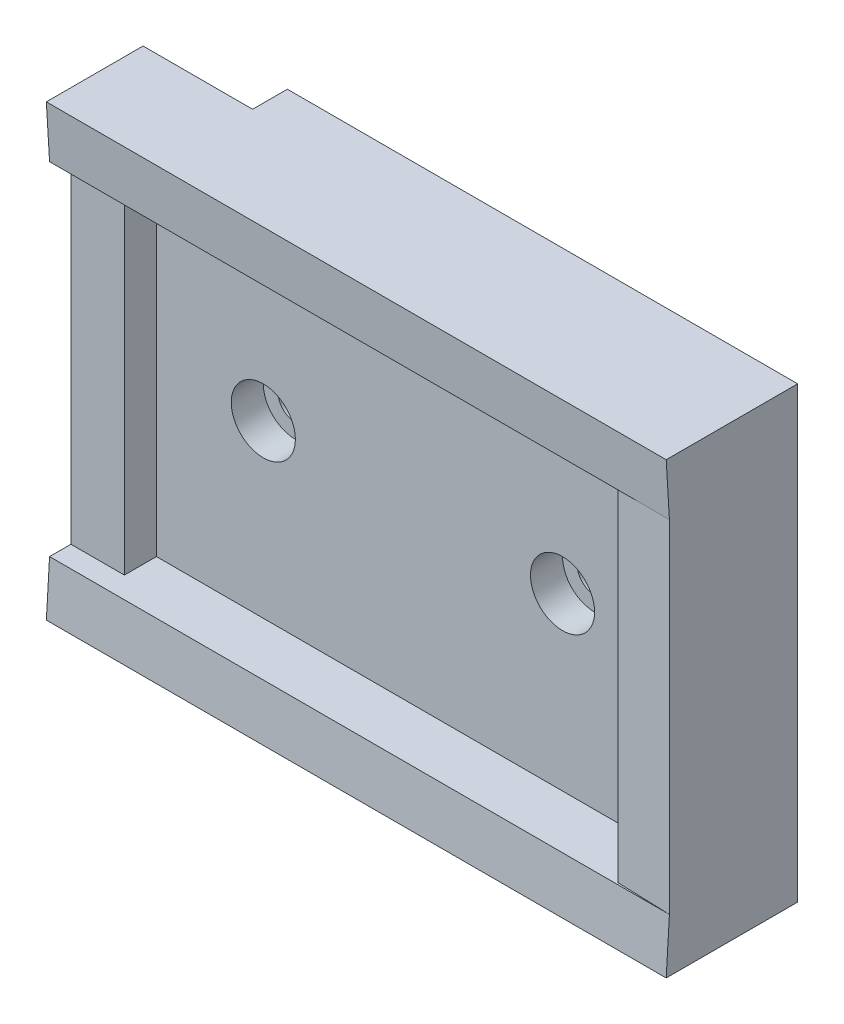
ISO-10303-21;
HEADER;
FILE_DESCRIPTION(('STEP AP214'),'2;1');
FILE_NAME('part.step','',(''),(''),'','','');
FILE_SCHEMA(('AUTOMOTIVE_DESIGN { 1 0 10303 214 1 1 1 1 }'));
ENDSEC;
DATA;
#1=APPLICATION_CONTEXT('core data for automotive mechanical design processes');
#2=APPLICATION_PROTOCOL_DEFINITION('international standard','automotive_design',2000,#1);
#3=PRODUCT_CONTEXT('',#1,'mechanical');
#4=PRODUCT('Part','Part','',(#3));
#5=PRODUCT_RELATED_PRODUCT_CATEGORY('part','',(#4));
#6=PRODUCT_DEFINITION_FORMATION('','',#4);
#7=PRODUCT_DEFINITION_CONTEXT('part definition',#1,'design');
#8=PRODUCT_DEFINITION('design','',#6,#7);
#9=PRODUCT_DEFINITION_SHAPE('','',#8);
#10=(LENGTH_UNIT() NAMED_UNIT(*) SI_UNIT(.MILLI.,.METRE.));
#11=(NAMED_UNIT(*) PLANE_ANGLE_UNIT() SI_UNIT($,.RADIAN.));
#12=(NAMED_UNIT(*) SI_UNIT($,.STERADIAN.) SOLID_ANGLE_UNIT());
#13=UNCERTAINTY_MEASURE_WITH_UNIT(LENGTH_MEASURE(1.E-05),#10,'distance_accuracy_value','');
#14=(GEOMETRIC_REPRESENTATION_CONTEXT(3) GLOBAL_UNCERTAINTY_ASSIGNED_CONTEXT((#13)) GLOBAL_UNIT_ASSIGNED_CONTEXT((#10,
#11,#12)) REPRESENTATION_CONTEXT('',''));
#15=CARTESIAN_POINT('',(0.,0.,0.));
#16=DIRECTION('',(0.,0.,1.));
#17=DIRECTION('',(1.,0.,0.));
#18=AXIS2_PLACEMENT_3D('',#15,#16,#17);
#19=CARTESIAN_POINT('',(0.,0.,7.));
#20=DIRECTION('',(1.,0.,0.));
#21=DIRECTION('',(0.,1.,0.));
#22=AXIS2_PLACEMENT_3D('',#19,#20,#21);
#23=PLANE('',#22);
#24=DIRECTION('',(0.,1.,0.));
#25=VECTOR('',#24,1.);
#26=CARTESIAN_POINT('',(0.,-42.,3.25));
#27=LINE('',#26,#25);
#28=CARTESIAN_POINT('',(0.,-37.,3.25));
#29=VERTEX_POINT('',#28);
#30=CARTESIAN_POINT('',(0.,4.99999999999999,3.25));
#31=VERTEX_POINT('',#30);
#32=EDGE_CURVE('E47',#29,#31,#27,.T.);
#33=ORIENTED_EDGE('',*,*,#32,.F.);
#34=DIRECTION('',(0.,0.,-1.));
#35=VECTOR('',#34,1.);
#36=CARTESIAN_POINT('',(0.,-37.,12.));
#37=LINE('',#36,#35);
#38=CARTESIAN_POINT('',(0.,-37.,12.3));
#39=VERTEX_POINT('',#38);
#40=EDGE_CURVE('E126',#39,#29,#37,.T.);
#41=ORIENTED_EDGE('',*,*,#40,.F.);
#42=DIRECTION('',(0.,0.998204845465779,-0.0598922907279467));
#43=VECTOR('',#42,1.);
#44=CARTESIAN_POINT('',(0.,-37.,12.3));
#45=LINE('',#44,#43);
#46=CARTESIAN_POINT('',(0.,-32.,12.));
#47=VERTEX_POINT('',#46);
#48=EDGE_CURVE('E303',#39,#47,#45,.T.);
#49=ORIENTED_EDGE('',*,*,#48,.T.);
#50=DIRECTION('',(0.,0.,-1.));
#51=VECTOR('',#50,1.);
#52=CARTESIAN_POINT('',(0.,-32.,12.));
#53=LINE('',#52,#51);
#54=CARTESIAN_POINT('',(0.,-32.,10.));
#55=VERTEX_POINT('',#54);
#56=EDGE_CURVE('E144',#47,#55,#53,.T.);
#57=ORIENTED_EDGE('',*,*,#56,.T.);
#58=DIRECTION('',(0.,-1.,0.));
#59=VECTOR('',#58,1.);
#60=CARTESIAN_POINT('',(0.,0.,10.));
#61=LINE('',#60,#59);
#62=CARTESIAN_POINT('',(0.,0.,10.));
#63=VERTEX_POINT('',#62);
#64=EDGE_CURVE('E206',#63,#55,#61,.T.);
#65=ORIENTED_EDGE('',*,*,#64,.F.);
#66=DIRECTION('',(0.,0.,-1.));
#67=VECTOR('',#66,1.);
#68=CARTESIAN_POINT('',(0.,0.,12.));
#69=LINE('',#68,#67);
#70=CARTESIAN_POINT('',(0.,0.,12.));
#71=VERTEX_POINT('',#70);
#72=EDGE_CURVE('E158',#71,#63,#69,.T.);
#73=ORIENTED_EDGE('',*,*,#72,.F.);
#74=DIRECTION('',(0.,0.998204845465779,0.0598922907279468));
#75=VECTOR('',#74,1.);
#76=CARTESIAN_POINT('',(0.,4.99999999999999,12.3));
#77=LINE('',#76,#75);
#78=CARTESIAN_POINT('',(0.,4.99999999999999,12.3));
#79=VERTEX_POINT('',#78);
#80=EDGE_CURVE('E295',#71,#79,#77,.T.);
#81=ORIENTED_EDGE('',*,*,#80,.T.);
#82=DIRECTION('',(0.,0.,-1.));
#83=VECTOR('',#82,1.);
#84=CARTESIAN_POINT('',(0.,4.99999999999999,12.));
#85=LINE('',#84,#83);
#86=EDGE_CURVE('E129',#79,#31,#85,.T.);
#87=ORIENTED_EDGE('',*,*,#86,.T.);
#88=EDGE_LOOP('',(#33,#41,#49,#57,#65,#73,#81,#87));
#89=FACE_BOUND('',#88,.T.);
#90=ADVANCED_FACE('F33',(#89),#23,.F.);
#91=CARTESIAN_POINT('',(0.,0.,0.));
#92=DIRECTION('',(0.,0.,1.));
#93=DIRECTION('',(1.,0.,0.));
#94=AXIS2_PLACEMENT_3D('',#91,#92,#93);
#95=PLANE('',#94);
#96=CARTESIAN_POINT('',(43.,-16.,0.));
#97=DIRECTION('',(0.,0.,1.));
#98=DIRECTION('',(1.,0.,0.));
#99=AXIS2_PLACEMENT_3D('',#96,#97,#98);
#100=CIRCLE('',#99,1.625);
#101=CARTESIAN_POINT('',(44.625,-16.,0.));
#102=VERTEX_POINT('',#101);
#103=EDGE_CURVE('E180',#102,#102,#100,.T.);
#104=ORIENTED_EDGE('',*,*,#103,.T.);
#105=EDGE_LOOP('',(#104));
#106=FACE_BOUND('',#105,.T.);
#107=CARTESIAN_POINT('',(15.,-16.,0.));
#108=DIRECTION('',(0.,0.,1.));
#109=DIRECTION('',(1.,0.,0.));
#110=AXIS2_PLACEMENT_3D('',#107,#108,#109);
#111=CIRCLE('',#110,1.625);
#112=CARTESIAN_POINT('',(16.625,-16.,0.));
#113=VERTEX_POINT('',#112);
#114=EDGE_CURVE('E184',#113,#113,#111,.T.);
#115=ORIENTED_EDGE('',*,*,#114,.T.);
#116=EDGE_LOOP('',(#115));
#117=FACE_BOUND('',#116,.T.);
#118=DIRECTION('',(1.,0.,0.));
#119=VECTOR('',#118,1.);
#120=CARTESIAN_POINT('',(58.,-37.,0.));
#121=LINE('',#120,#119);
#122=CARTESIAN_POINT('',(10.25,-37.,0.));
#123=VERTEX_POINT('',#122);
#124=CARTESIAN_POINT('',(58.,-37.,0.));
#125=VERTEX_POINT('',#124);
#126=EDGE_CURVE('E290',#123,#125,#121,.T.);
#127=ORIENTED_EDGE('',*,*,#126,.F.);
#128=DIRECTION('',(0.,-1.,0.));
#129=VECTOR('',#128,1.);
#130=CARTESIAN_POINT('',(10.25,0.,0.));
#131=LINE('',#130,#129);
#132=CARTESIAN_POINT('',(10.25,4.99999999999999,0.));
#133=VERTEX_POINT('',#132);
#134=EDGE_CURVE('E11',#133,#123,#131,.T.);
#135=ORIENTED_EDGE('',*,*,#134,.F.);
#136=DIRECTION('',(-1.,0.,0.));
#137=VECTOR('',#136,1.);
#138=CARTESIAN_POINT('',(58.,5.,0.));
#139=LINE('',#138,#137);
#140=CARTESIAN_POINT('',(58.,5.,0.));
#141=VERTEX_POINT('',#140);
#142=EDGE_CURVE('E148',#141,#133,#139,.T.);
#143=ORIENTED_EDGE('',*,*,#142,.F.);
#144=DIRECTION('',(0.,1.,0.));
#145=VECTOR('',#144,1.);
#146=CARTESIAN_POINT('',(58.,0.,0.));
#147=LINE('',#146,#145);
#148=EDGE_CURVE('E224',#125,#141,#147,.T.);
#149=ORIENTED_EDGE('',*,*,#148,.F.);
#150=EDGE_LOOP('',(#127,#135,#143,#149));
#151=FACE_BOUND('',#150,.T.);
#152=ADVANCED_FACE('F249',(#106,#117,#151),#95,.F.);
#153=CARTESIAN_POINT('',(58.,5.,12.));
#154=DIRECTION('',(0.,-1.,0.));
#155=DIRECTION('',(1.,0.,0.));
#156=AXIS2_PLACEMENT_3D('',#153,#154,#155);
#157=PLANE('',#156);
#158=DIRECTION('',(0.,0.,-1.));
#159=VECTOR('',#158,1.);
#160=CARTESIAN_POINT('',(10.25,4.99999999999999,3.25));
#161=LINE('',#160,#159);
#162=CARTESIAN_POINT('',(10.25,4.99999999999999,3.25));
#163=VERTEX_POINT('',#162);
#164=EDGE_CURVE('E138',#163,#133,#161,.T.);
#165=ORIENTED_EDGE('',*,*,#164,.F.);
#166=DIRECTION('',(1.,0.,0.));
#167=VECTOR('',#166,1.);
#168=CARTESIAN_POINT('',(0.,4.99999999999999,3.25));
#169=LINE('',#168,#167);
#170=EDGE_CURVE('E307',#31,#163,#169,.T.);
#171=ORIENTED_EDGE('',*,*,#170,.F.);
#172=ORIENTED_EDGE('',*,*,#86,.F.);
#173=DIRECTION('',(-1.,0.,0.));
#174=VECTOR('',#173,1.);
#175=CARTESIAN_POINT('',(58.,5.,12.3));
#176=LINE('',#175,#174);
#177=CARTESIAN_POINT('',(58.,5.,12.3));
#178=VERTEX_POINT('',#177);
#179=EDGE_CURVE('E286',#178,#79,#176,.T.);
#180=ORIENTED_EDGE('',*,*,#179,.F.);
#181=DIRECTION('',(0.,0.,-1.));
#182=VECTOR('',#181,1.);
#183=CARTESIAN_POINT('',(58.,5.,12.));
#184=LINE('',#183,#182);
#185=EDGE_CURVE('E130',#178,#141,#184,.T.);
#186=ORIENTED_EDGE('',*,*,#185,.T.);
#187=ORIENTED_EDGE('',*,*,#142,.T.);
#188=EDGE_LOOP('',(#165,#171,#172,#180,#186,#187));
#189=FACE_BOUND('',#188,.T.);
#190=ADVANCED_FACE('F239',(#189),#157,.F.);
#191=CARTESIAN_POINT('',(15.,-16.,0.));
#192=DIRECTION('',(0.,0.,1.));
#193=DIRECTION('',(1.,0.,0.));
#194=AXIS2_PLACEMENT_3D('',#191,#192,#193);
#195=CYLINDRICAL_SURFACE('',#194,1.625);
#196=ORIENTED_EDGE('',*,*,#114,.F.);
#197=EDGE_LOOP('',(#196));
#198=FACE_BOUND('',#197,.T.);
#199=CARTESIAN_POINT('',(15.,-16.,4.));
#200=DIRECTION('',(0.,0.,1.));
#201=DIRECTION('',(1.,0.,0.));
#202=AXIS2_PLACEMENT_3D('',#199,#200,#201);
#203=CIRCLE('',#202,1.625);
#204=CARTESIAN_POINT('',(16.625,-16.,4.));
#205=VERTEX_POINT('',#204);
#206=EDGE_CURVE('E187',#205,#205,#203,.F.);
#207=ORIENTED_EDGE('',*,*,#206,.F.);
#208=EDGE_LOOP('',(#207));
#209=FACE_BOUND('',#208,.T.);
#210=ADVANCED_FACE('F236',(#198,#209),#195,.F.);
#211=CARTESIAN_POINT('',(43.,-16.,0.));
#212=DIRECTION('',(0.,0.,1.));
#213=DIRECTION('',(1.,0.,0.));
#214=AXIS2_PLACEMENT_3D('',#211,#212,#213);
#215=CYLINDRICAL_SURFACE('',#214,1.625);
#216=ORIENTED_EDGE('',*,*,#103,.F.);
#217=EDGE_LOOP('',(#216));
#218=FACE_BOUND('',#217,.T.);
#219=CARTESIAN_POINT('',(43.,-16.,4.));
#220=DIRECTION('',(0.,0.,1.));
#221=DIRECTION('',(1.,0.,0.));
#222=AXIS2_PLACEMENT_3D('',#219,#220,#221);
#223=CIRCLE('',#222,1.625);
#224=CARTESIAN_POINT('',(44.625,-16.,4.));
#225=VERTEX_POINT('',#224);
#226=EDGE_CURVE('E171',#225,#225,#223,.F.);
#227=ORIENTED_EDGE('',*,*,#226,.F.);
#228=EDGE_LOOP('',(#227));
#229=FACE_BOUND('',#228,.T.);
#230=ADVANCED_FACE('F238',(#218,#229),#215,.F.);
#231=CARTESIAN_POINT('',(0.,0.,7.));
#232=DIRECTION('',(0.,0.,1.));
#233=DIRECTION('',(1.,0.,0.));
#234=AXIS2_PLACEMENT_3D('',#231,#232,#233);
#235=PLANE('',#234);
#236=CARTESIAN_POINT('',(15.,-16.,7.));
#237=DIRECTION('',(0.,0.,1.));
#238=DIRECTION('',(1.,0.,0.));
#239=AXIS2_PLACEMENT_3D('',#236,#237,#238);
#240=CIRCLE('',#239,3.);
#241=CARTESIAN_POINT('',(18.,-16.,7.));
#242=VERTEX_POINT('',#241);
#243=EDGE_CURVE('E172',#242,#242,#240,.T.);
#244=ORIENTED_EDGE('',*,*,#243,.F.);
#245=EDGE_LOOP('',(#244));
#246=FACE_BOUND('',#245,.T.);
#247=CARTESIAN_POINT('',(43.,-16.,7.));
#248=DIRECTION('',(0.,0.,1.));
#249=DIRECTION('',(1.,0.,0.));
#250=AXIS2_PLACEMENT_3D('',#247,#248,#249);
#251=CIRCLE('',#250,3.);
#252=CARTESIAN_POINT('',(46.,-16.,7.));
#253=VERTEX_POINT('',#252);
#254=EDGE_CURVE('E167',#253,#253,#251,.T.);
#255=ORIENTED_EDGE('',*,*,#254,.F.);
#256=EDGE_LOOP('',(#255));
#257=FACE_BOUND('',#256,.T.);
#258=DIRECTION('',(1.,0.,0.));
#259=VECTOR('',#258,1.);
#260=CARTESIAN_POINT('',(0.,-32.,7.));
#261=LINE('',#260,#259);
#262=CARTESIAN_POINT('',(5.,-32.,7.));
#263=VERTEX_POINT('',#262);
#264=CARTESIAN_POINT('',(53.,-32.,7.));
#265=VERTEX_POINT('',#264);
#266=EDGE_CURVE('E225',#263,#265,#261,.T.);
#267=ORIENTED_EDGE('',*,*,#266,.T.);
#268=DIRECTION('',(0.,-1.,0.));
#269=VECTOR('',#268,1.);
#270=CARTESIAN_POINT('',(53.,0.,7.));
#271=LINE('',#270,#269);
#272=CARTESIAN_POINT('',(53.,0.,7.));
#273=VERTEX_POINT('',#272);
#274=EDGE_CURVE('E196',#273,#265,#271,.T.);
#275=ORIENTED_EDGE('',*,*,#274,.F.);
#276=DIRECTION('',(-1.,0.,0.));
#277=VECTOR('',#276,1.);
#278=CARTESIAN_POINT('',(0.,0.,7.));
#279=LINE('',#278,#277);
#280=CARTESIAN_POINT('',(5.,0.,7.));
#281=VERTEX_POINT('',#280);
#282=EDGE_CURVE('E40',#273,#281,#279,.T.);
#283=ORIENTED_EDGE('',*,*,#282,.T.);
#284=DIRECTION('',(0.,1.,0.));
#285=VECTOR('',#284,1.);
#286=CARTESIAN_POINT('',(5.,0.,7.));
#287=LINE('',#286,#285);
#288=EDGE_CURVE('E205',#263,#281,#287,.T.);
#289=ORIENTED_EDGE('',*,*,#288,.F.);
#290=EDGE_LOOP('',(#267,#275,#283,#289));
#291=FACE_BOUND('',#290,.T.);
#292=ADVANCED_FACE('F246',(#246,#257,#291),#235,.T.);
#293=CARTESIAN_POINT('',(58.,0.,7.));
#294=DIRECTION('',(-1.,0.,0.));
#295=DIRECTION('',(0.,0.,1.));
#296=AXIS2_PLACEMENT_3D('',#293,#294,#295);
#297=PLANE('',#296);
#298=ORIENTED_EDGE('',*,*,#148,.T.);
#299=ORIENTED_EDGE('',*,*,#185,.F.);
#300=DIRECTION('',(0.,0.998204845465779,0.0598922907279468));
#301=VECTOR('',#300,1.);
#302=CARTESIAN_POINT('',(58.,5.,12.3));
#303=LINE('',#302,#301);
#304=CARTESIAN_POINT('',(58.,0.,12.));
#305=VERTEX_POINT('',#304);
#306=EDGE_CURVE('E291',#305,#178,#303,.T.);
#307=ORIENTED_EDGE('',*,*,#306,.F.);
#308=DIRECTION('',(0.,1.,0.));
#309=VECTOR('',#308,1.);
#310=CARTESIAN_POINT('',(58.,0.,12.));
#311=LINE('',#310,#309);
#312=CARTESIAN_POINT('',(58.,-32.,12.));
#313=VERTEX_POINT('',#312);
#314=EDGE_CURVE('E197',#313,#305,#311,.T.);
#315=ORIENTED_EDGE('',*,*,#314,.F.);
#316=DIRECTION('',(0.,0.998204845465779,-0.0598922907279467));
#317=VECTOR('',#316,1.);
#318=CARTESIAN_POINT('',(58.,-37.,12.3));
#319=LINE('',#318,#317);
#320=CARTESIAN_POINT('',(58.,-37.,12.3));
#321=VERTEX_POINT('',#320);
#322=EDGE_CURVE('E305',#321,#313,#319,.T.);
#323=ORIENTED_EDGE('',*,*,#322,.F.);
#324=DIRECTION('',(0.,0.,-1.));
#325=VECTOR('',#324,1.);
#326=CARTESIAN_POINT('',(58.,-37.,12.));
#327=LINE('',#326,#325);
#328=EDGE_CURVE('E145',#321,#125,#327,.T.);
#329=ORIENTED_EDGE('',*,*,#328,.T.);
#330=EDGE_LOOP('',(#298,#299,#307,#315,#323,#329));
#331=FACE_BOUND('',#330,.T.);
#332=ADVANCED_FACE('F265',(#331),#297,.F.);
#333=CARTESIAN_POINT('',(5.,0.,10.));
#334=DIRECTION('',(-1.,0.,0.));
#335=DIRECTION('',(0.,-1.,0.));
#336=AXIS2_PLACEMENT_3D('',#333,#334,#335);
#337=PLANE('',#336);
#338=ORIENTED_EDGE('',*,*,#288,.T.);
#339=DIRECTION('',(0.,0.,-1.));
#340=VECTOR('',#339,1.);
#341=CARTESIAN_POINT('',(5.,0.,10.));
#342=LINE('',#341,#340);
#343=CARTESIAN_POINT('',(5.,0.,10.));
#344=VERTEX_POINT('',#343);
#345=EDGE_CURVE('E216',#344,#281,#342,.T.);
#346=ORIENTED_EDGE('',*,*,#345,.F.);
#347=DIRECTION('',(0.,1.,0.));
#348=VECTOR('',#347,1.);
#349=CARTESIAN_POINT('',(5.,0.,10.));
#350=LINE('',#349,#348);
#351=CARTESIAN_POINT('',(5.,-32.,10.));
#352=VERTEX_POINT('',#351);
#353=EDGE_CURVE('E212',#352,#344,#350,.T.);
#354=ORIENTED_EDGE('',*,*,#353,.F.);
#355=DIRECTION('',(0.,0.,-1.));
#356=VECTOR('',#355,1.);
#357=CARTESIAN_POINT('',(5.,-32.,10.));
#358=LINE('',#357,#356);
#359=EDGE_CURVE('E221',#352,#263,#358,.T.);
#360=ORIENTED_EDGE('',*,*,#359,.T.);
#361=EDGE_LOOP('',(#338,#346,#354,#360));
#362=FACE_BOUND('',#361,.T.);
#363=ADVANCED_FACE('F267',(#362),#337,.F.);
#364=CARTESIAN_POINT('',(0.,0.,10.));
#365=DIRECTION('',(0.,0.,1.));
#366=DIRECTION('',(1.,0.,0.));
#367=AXIS2_PLACEMENT_3D('',#364,#365,#366);
#368=PLANE('',#367);
#369=ORIENTED_EDGE('',*,*,#64,.T.);
#370=DIRECTION('',(1.,0.,0.));
#371=VECTOR('',#370,1.);
#372=CARTESIAN_POINT('',(0.,-32.,10.));
#373=LINE('',#372,#371);
#374=EDGE_CURVE('E209',#55,#352,#373,.T.);
#375=ORIENTED_EDGE('',*,*,#374,.T.);
#376=ORIENTED_EDGE('',*,*,#353,.T.);
#377=DIRECTION('',(-1.,0.,0.));
#378=VECTOR('',#377,1.);
#379=CARTESIAN_POINT('',(0.,0.,10.));
#380=LINE('',#379,#378);
#381=EDGE_CURVE('E214',#344,#63,#380,.T.);
#382=ORIENTED_EDGE('',*,*,#381,.T.);
#383=EDGE_LOOP('',(#369,#375,#376,#382));
#384=FACE_BOUND('',#383,.T.);
#385=ADVANCED_FACE('F273',(#384),#368,.T.);
#386=CARTESIAN_POINT('',(53.,0.,12.));
#387=DIRECTION('',(1.,0.,0.));
#388=DIRECTION('',(0.,1.,0.));
#389=AXIS2_PLACEMENT_3D('',#386,#387,#388);
#390=PLANE('',#389);
#391=DIRECTION('',(0.,0.,-1.));
#392=VECTOR('',#391,1.);
#393=CARTESIAN_POINT('',(53.,-32.,12.));
#394=LINE('',#393,#392);
#395=CARTESIAN_POINT('',(53.,-32.,11.8275862068966));
#396=VERTEX_POINT('',#395);
#397=EDGE_CURVE('E199',#396,#265,#394,.T.);
#398=ORIENTED_EDGE('',*,*,#397,.F.);
#399=DIRECTION('',(0.,1.,0.));
#400=VECTOR('',#399,1.);
#401=CARTESIAN_POINT('',(53.,0.,11.8275862068966));
#402=LINE('',#401,#400);
#403=CARTESIAN_POINT('',(53.,0.,11.8275862068966));
#404=VERTEX_POINT('',#403);
#405=EDGE_CURVE('E191',#396,#404,#402,.T.);
#406=ORIENTED_EDGE('',*,*,#405,.T.);
#407=DIRECTION('',(0.,0.,-1.));
#408=VECTOR('',#407,1.);
#409=CARTESIAN_POINT('',(53.,0.,12.));
#410=LINE('',#409,#408);
#411=EDGE_CURVE('E203',#404,#273,#410,.T.);
#412=ORIENTED_EDGE('',*,*,#411,.T.);
#413=ORIENTED_EDGE('',*,*,#274,.T.);
#414=EDGE_LOOP('',(#398,#406,#412,#413));
#415=FACE_BOUND('',#414,.T.);
#416=ADVANCED_FACE('F325',(#415),#390,.F.);
#417=CARTESIAN_POINT('',(0.,0.,10.));
#418=DIRECTION('',(0.0344622758397789,0.,-0.999405999353588));
#419=DIRECTION('',(-0.999405999353588,0.,-0.0344622758397789));
#420=AXIS2_PLACEMENT_3D('',#417,#418,#419);
#421=PLANE('',#420);
#422=DIRECTION('',(0.999405999353587,0.,0.0344622758397789));
#423=VECTOR('',#422,1.);
#424=CARTESIAN_POINT('',(0.,-32.,10.));
#425=LINE('',#424,#423);
#426=EDGE_CURVE('E183',#396,#313,#425,.T.);
#427=ORIENTED_EDGE('',*,*,#426,.T.);
#428=ORIENTED_EDGE('',*,*,#314,.T.);
#429=DIRECTION('',(0.999405999353587,0.,0.0344622758397789));
#430=VECTOR('',#429,1.);
#431=CARTESIAN_POINT('',(0.,0.,10.));
#432=LINE('',#431,#430);
#433=EDGE_CURVE('E188',#404,#305,#432,.T.);
#434=ORIENTED_EDGE('',*,*,#433,.F.);
#435=ORIENTED_EDGE('',*,*,#405,.F.);
#436=EDGE_LOOP('',(#427,#428,#434,#435));
#437=FACE_BOUND('',#436,.T.);
#438=ADVANCED_FACE('F314',(#437),#421,.F.);
#439=CARTESIAN_POINT('',(43.,-16.,4.));
#440=DIRECTION('',(0.,0.,1.));
#441=DIRECTION('',(1.,0.,0.));
#442=AXIS2_PLACEMENT_3D('',#439,#440,#441);
#443=PLANE('',#442);
#444=CARTESIAN_POINT('',(43.,-16.,4.));
#445=DIRECTION('',(0.,0.,1.));
#446=DIRECTION('',(1.,0.,0.));
#447=AXIS2_PLACEMENT_3D('',#444,#445,#446);
#448=CIRCLE('',#447,3.);
#449=CARTESIAN_POINT('',(46.,-16.,4.));
#450=VERTEX_POINT('',#449);
#451=EDGE_CURVE('E175',#450,#450,#448,.T.);
#452=ORIENTED_EDGE('',*,*,#451,.T.);
#453=EDGE_LOOP('',(#452));
#454=FACE_BOUND('',#453,.T.);
#455=ORIENTED_EDGE('',*,*,#226,.T.);
#456=EDGE_LOOP('',(#455));
#457=FACE_BOUND('',#456,.T.);
#458=ADVANCED_FACE('F341',(#454,#457),#443,.T.);
#459=CARTESIAN_POINT('',(43.,-16.,4.));
#460=DIRECTION('',(0.,0.,1.));
#461=DIRECTION('',(1.,0.,0.));
#462=AXIS2_PLACEMENT_3D('',#459,#460,#461);
#463=CYLINDRICAL_SURFACE('',#462,3.);
#464=ORIENTED_EDGE('',*,*,#451,.F.);
#465=EDGE_LOOP('',(#464));
#466=FACE_BOUND('',#465,.T.);
#467=ORIENTED_EDGE('',*,*,#254,.T.);
#468=EDGE_LOOP('',(#467));
#469=FACE_BOUND('',#468,.T.);
#470=ADVANCED_FACE('F345',(#466,#469),#463,.F.);
#471=CARTESIAN_POINT('',(15.,-16.,4.));
#472=DIRECTION('',(0.,0.,1.));
#473=DIRECTION('',(1.,0.,0.));
#474=AXIS2_PLACEMENT_3D('',#471,#472,#473);
#475=PLANE('',#474);
#476=CARTESIAN_POINT('',(15.,-16.,4.));
#477=DIRECTION('',(0.,0.,1.));
#478=DIRECTION('',(1.,0.,0.));
#479=AXIS2_PLACEMENT_3D('',#476,#477,#478);
#480=CIRCLE('',#479,3.);
#481=CARTESIAN_POINT('',(18.,-16.,4.));
#482=VERTEX_POINT('',#481);
#483=EDGE_CURVE('E168',#482,#482,#480,.T.);
#484=ORIENTED_EDGE('',*,*,#483,.T.);
#485=EDGE_LOOP('',(#484));
#486=FACE_BOUND('',#485,.T.);
#487=ORIENTED_EDGE('',*,*,#206,.T.);
#488=EDGE_LOOP('',(#487));
#489=FACE_BOUND('',#488,.T.);
#490=ADVANCED_FACE('F234',(#486,#489),#475,.T.);
#491=CARTESIAN_POINT('',(15.,-16.,4.));
#492=DIRECTION('',(0.,0.,1.));
#493=DIRECTION('',(1.,0.,0.));
#494=AXIS2_PLACEMENT_3D('',#491,#492,#493);
#495=CYLINDRICAL_SURFACE('',#494,3.);
#496=ORIENTED_EDGE('',*,*,#483,.F.);
#497=EDGE_LOOP('',(#496));
#498=FACE_BOUND('',#497,.T.);
#499=ORIENTED_EDGE('',*,*,#243,.T.);
#500=EDGE_LOOP('',(#499));
#501=FACE_BOUND('',#500,.T.);
#502=ADVANCED_FACE('F355',(#498,#501),#495,.F.);
#503=CARTESIAN_POINT('',(0.,-42.,3.25));
#504=DIRECTION('',(0.,0.,-1.));
#505=DIRECTION('',(-1.,0.,0.));
#506=AXIS2_PLACEMENT_3D('',#503,#504,#505);
#507=PLANE('',#506);
#508=DIRECTION('',(0.,1.,0.));
#509=VECTOR('',#508,1.);
#510=CARTESIAN_POINT('',(10.25,-42.,3.25));
#511=LINE('',#510,#509);
#512=CARTESIAN_POINT('',(10.25,-37.,3.25));
#513=VERTEX_POINT('',#512);
#514=EDGE_CURVE('E52',#513,#163,#511,.T.);
#515=ORIENTED_EDGE('',*,*,#514,.F.);
#516=DIRECTION('',(-1.,0.,0.));
#517=VECTOR('',#516,1.);
#518=CARTESIAN_POINT('',(0.,-37.,3.25));
#519=LINE('',#518,#517);
#520=EDGE_CURVE('E133',#513,#29,#519,.T.);
#521=ORIENTED_EDGE('',*,*,#520,.T.);
#522=ORIENTED_EDGE('',*,*,#32,.T.);
#523=ORIENTED_EDGE('',*,*,#170,.T.);
#524=EDGE_LOOP('',(#515,#521,#522,#523));
#525=FACE_BOUND('',#524,.T.);
#526=ADVANCED_FACE('F134',(#525),#507,.T.);
#527=CARTESIAN_POINT('',(10.25,-42.,0.));
#528=DIRECTION('',(-1.,0.,0.));
#529=DIRECTION('',(0.,0.,1.));
#530=AXIS2_PLACEMENT_3D('',#527,#528,#529);
#531=PLANE('',#530);
#532=ORIENTED_EDGE('',*,*,#134,.T.);
#533=DIRECTION('',(0.,0.,-1.));
#534=VECTOR('',#533,1.);
#535=CARTESIAN_POINT('',(10.25,-37.,3.25));
#536=LINE('',#535,#534);
#537=EDGE_CURVE('E137',#513,#123,#536,.T.);
#538=ORIENTED_EDGE('',*,*,#537,.F.);
#539=ORIENTED_EDGE('',*,*,#514,.T.);
#540=ORIENTED_EDGE('',*,*,#164,.T.);
#541=EDGE_LOOP('',(#532,#538,#539,#540));
#542=FACE_BOUND('',#541,.T.);
#543=ADVANCED_FACE('F362',(#542),#531,.T.);
#544=CARTESIAN_POINT('',(58.,0.,12.));
#545=DIRECTION('',(0.,1.,0.));
#546=DIRECTION('',(0.,0.,1.));
#547=AXIS2_PLACEMENT_3D('',#544,#545,#546);
#548=PLANE('',#547);
#549=ORIENTED_EDGE('',*,*,#381,.F.);
#550=ORIENTED_EDGE('',*,*,#345,.T.);
#551=ORIENTED_EDGE('',*,*,#282,.F.);
#552=ORIENTED_EDGE('',*,*,#411,.F.);
#553=ORIENTED_EDGE('',*,*,#433,.T.);
#554=DIRECTION('',(1.,0.,0.));
#555=VECTOR('',#554,1.);
#556=CARTESIAN_POINT('',(58.,0.,12.));
#557=LINE('',#556,#555);
#558=EDGE_CURVE('E155',#71,#305,#557,.T.);
#559=ORIENTED_EDGE('',*,*,#558,.F.);
#560=ORIENTED_EDGE('',*,*,#72,.T.);
#561=EDGE_LOOP('',(#549,#550,#551,#552,#553,#559,#560));
#562=FACE_BOUND('',#561,.T.);
#563=ADVANCED_FACE('F319',(#562),#548,.F.);
#564=CARTESIAN_POINT('',(58.,-32.,12.));
#565=DIRECTION('',(0.,-1.,0.));
#566=DIRECTION('',(0.,0.,-1.));
#567=AXIS2_PLACEMENT_3D('',#564,#565,#566);
#568=PLANE('',#567);
#569=ORIENTED_EDGE('',*,*,#426,.F.);
#570=ORIENTED_EDGE('',*,*,#397,.T.);
#571=ORIENTED_EDGE('',*,*,#266,.F.);
#572=ORIENTED_EDGE('',*,*,#359,.F.);
#573=ORIENTED_EDGE('',*,*,#374,.F.);
#574=ORIENTED_EDGE('',*,*,#56,.F.);
#575=DIRECTION('',(-1.,0.,0.));
#576=VECTOR('',#575,1.);
#577=CARTESIAN_POINT('',(58.,-32.,12.));
#578=LINE('',#577,#576);
#579=EDGE_CURVE('E151',#313,#47,#578,.T.);
#580=ORIENTED_EDGE('',*,*,#579,.F.);
#581=EDGE_LOOP('',(#569,#570,#571,#572,#573,#574,#580));
#582=FACE_BOUND('',#581,.T.);
#583=ADVANCED_FACE('F329',(#582),#568,.F.);
#584=CARTESIAN_POINT('',(58.,-37.,12.));
#585=DIRECTION('',(0.,1.,0.));
#586=DIRECTION('',(-1.,0.,0.));
#587=AXIS2_PLACEMENT_3D('',#584,#585,#586);
#588=PLANE('',#587);
#589=ORIENTED_EDGE('',*,*,#520,.F.);
#590=ORIENTED_EDGE('',*,*,#537,.T.);
#591=ORIENTED_EDGE('',*,*,#126,.T.);
#592=ORIENTED_EDGE('',*,*,#328,.F.);
#593=DIRECTION('',(-1.,0.,0.));
#594=VECTOR('',#593,1.);
#595=CARTESIAN_POINT('',(58.,-37.,12.3));
#596=LINE('',#595,#594);
#597=EDGE_CURVE('E142',#321,#39,#596,.T.);
#598=ORIENTED_EDGE('',*,*,#597,.T.);
#599=ORIENTED_EDGE('',*,*,#40,.T.);
#600=EDGE_LOOP('',(#589,#590,#591,#592,#598,#599));
#601=FACE_BOUND('',#600,.T.);
#602=ADVANCED_FACE('F140',(#601),#588,.F.);
#603=CARTESIAN_POINT('',(58.,5.,12.3));
#604=DIRECTION('',(0.,-0.0598922907279468,0.998204845465779));
#605=DIRECTION('',(0.,-0.998204845465779,-0.0598922907279468));
#606=AXIS2_PLACEMENT_3D('',#603,#604,#605);
#607=PLANE('',#606);
#608=ORIENTED_EDGE('',*,*,#80,.F.);
#609=ORIENTED_EDGE('',*,*,#558,.T.);
#610=ORIENTED_EDGE('',*,*,#306,.T.);
#611=ORIENTED_EDGE('',*,*,#179,.T.);
#612=EDGE_LOOP('',(#608,#609,#610,#611));
#613=FACE_BOUND('',#612,.T.);
#614=ADVANCED_FACE('F293',(#613),#607,.T.);
#615=CARTESIAN_POINT('',(58.,-37.,12.3));
#616=DIRECTION('',(0.,0.0598922907279467,0.998204845465779));
#617=DIRECTION('',(0.,-0.998204845465779,0.0598922907279467));
#618=AXIS2_PLACEMENT_3D('',#615,#616,#617);
#619=PLANE('',#618);
#620=ORIENTED_EDGE('',*,*,#48,.F.);
#621=ORIENTED_EDGE('',*,*,#597,.F.);
#622=ORIENTED_EDGE('',*,*,#322,.T.);
#623=ORIENTED_EDGE('',*,*,#579,.T.);
#624=EDGE_LOOP('',(#620,#621,#622,#623));
#625=FACE_BOUND('',#624,.T.);
#626=ADVANCED_FACE('F312',(#625),#619,.T.);
#627=CLOSED_SHELL('',(#90,#152,#190,#210,#230,#292,#332,#363,#385,#416,#438,#458,#470,#490,#502,
#526,#543,#563,#583,#602,#614,#626));
#628=MANIFOLD_SOLID_BREP('B2',#627);
#629=ADVANCED_BREP_SHAPE_REPRESENTATION('',(#18,#628),#14);
#630=SHAPE_DEFINITION_REPRESENTATION(#9,#629);
ENDSEC;
END-ISO-10303-21;
